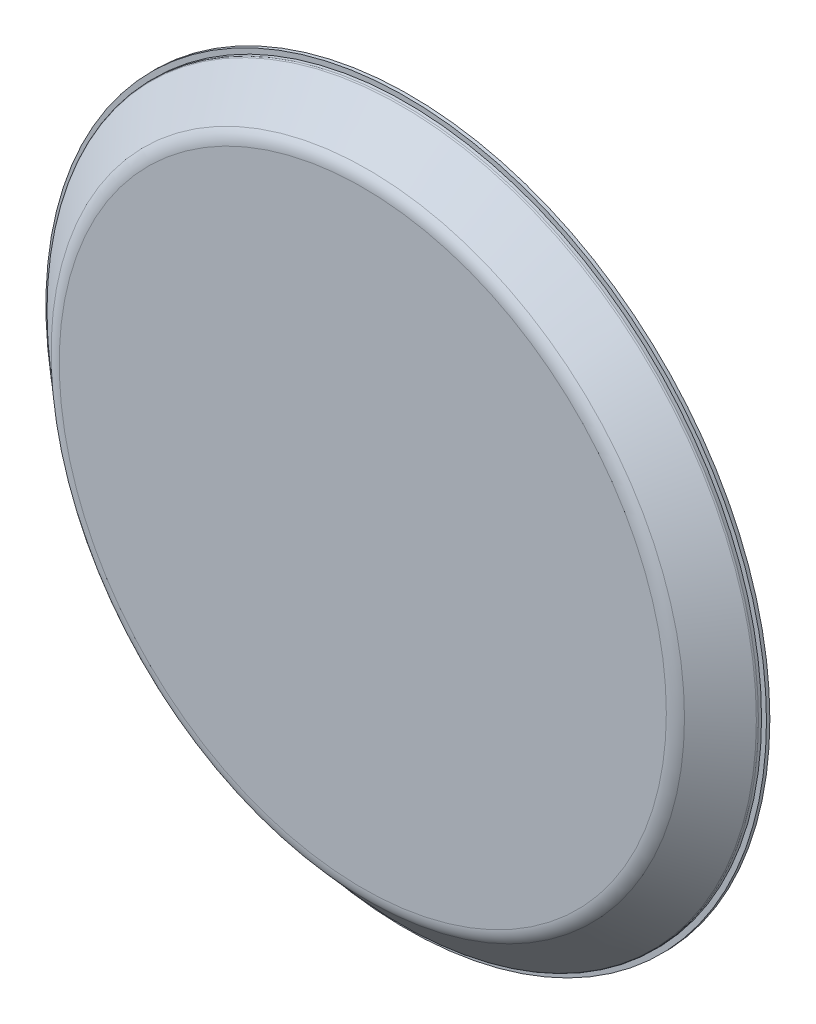
ISO-10303-21;
HEADER;
FILE_DESCRIPTION(('STEP AP214'),'2;1');
FILE_NAME('part.step','',(''),(''),'','','');
FILE_SCHEMA(('AUTOMOTIVE_DESIGN { 1 0 10303 214 1 1 1 1 }'));
ENDSEC;
DATA;
#1=APPLICATION_CONTEXT('core data for automotive mechanical design processes');
#2=APPLICATION_PROTOCOL_DEFINITION('international standard','automotive_design',2000,#1);
#3=PRODUCT_CONTEXT('',#1,'mechanical');
#4=PRODUCT('Part','Part','',(#3));
#5=PRODUCT_RELATED_PRODUCT_CATEGORY('part','',(#4));
#6=PRODUCT_DEFINITION_FORMATION('','',#4);
#7=PRODUCT_DEFINITION_CONTEXT('part definition',#1,'design');
#8=PRODUCT_DEFINITION('design','',#6,#7);
#9=PRODUCT_DEFINITION_SHAPE('','',#8);
#10=(LENGTH_UNIT() NAMED_UNIT(*) SI_UNIT(.MILLI.,.METRE.));
#11=(NAMED_UNIT(*) PLANE_ANGLE_UNIT() SI_UNIT($,.RADIAN.));
#12=(NAMED_UNIT(*) SI_UNIT($,.STERADIAN.) SOLID_ANGLE_UNIT());
#13=UNCERTAINTY_MEASURE_WITH_UNIT(LENGTH_MEASURE(1.E-05),#10,'distance_accuracy_value','');
#14=(GEOMETRIC_REPRESENTATION_CONTEXT(3) GLOBAL_UNCERTAINTY_ASSIGNED_CONTEXT((#13)) GLOBAL_UNIT_ASSIGNED_CONTEXT((#10,
#11,#12)) REPRESENTATION_CONTEXT('',''));
#15=CARTESIAN_POINT('',(0.,0.,0.));
#16=DIRECTION('',(0.,0.,1.));
#17=DIRECTION('',(1.,0.,0.));
#18=AXIS2_PLACEMENT_3D('',#15,#16,#17);
#19=CARTESIAN_POINT('',(0.,18.2536498750077,-0.368480901052237));
#20=DIRECTION('',(0.,0.,1.));
#21=DIRECTION('',(1.,0.,0.));
#22=AXIS2_PLACEMENT_3D('',#19,#20,#21);
#23=PLANE('',#22);
#24=CARTESIAN_POINT('',(0.,0.,-0.368480901052237));
#25=DIRECTION('',(0.,0.,1.));
#26=DIRECTION('',(1.,0.,0.));
#27=AXIS2_PLACEMENT_3D('',#24,#25,#26);
#28=CIRCLE('',#27,18.2536498750077);
#29=CARTESIAN_POINT('',(18.2536498750077,0.,-0.368480901052237));
#30=VERTEX_POINT('',#29);
#31=EDGE_CURVE('E83',#30,#30,#28,.T.);
#32=ORIENTED_EDGE('',*,*,#31,.F.);
#33=EDGE_LOOP('',(#32));
#34=FACE_BOUND('',#33,.T.);
#35=CARTESIAN_POINT('',(0.,0.,-0.368480901052237));
#36=DIRECTION('',(0.,0.,1.));
#37=DIRECTION('',(1.,0.,0.));
#38=AXIS2_PLACEMENT_3D('',#35,#36,#37);
#39=CIRCLE('',#38,17.5641984715067);
#40=CARTESIAN_POINT('',(17.5641984715067,0.,-0.368480901052237));
#41=VERTEX_POINT('',#40);
#42=EDGE_CURVE('E10',#41,#41,#39,.T.);
#43=ORIENTED_EDGE('',*,*,#42,.T.);
#44=EDGE_LOOP('',(#43));
#45=FACE_BOUND('',#44,.T.);
#46=ADVANCED_FACE('F36',(#34,#45),#23,.F.);
#47=CARTESIAN_POINT('',(0.,0.,-0.268480901052237));
#48=DIRECTION('',(0.,0.,1.));
#49=DIRECTION('',(1.,0.,0.));
#50=AXIS2_PLACEMENT_3D('',#47,#48,#49);
#51=TOROIDAL_SURFACE('',#50,17.5641984715067,0.0999999999999997);
#52=ORIENTED_EDGE('',*,*,#42,.F.);
#53=EDGE_LOOP('',(#52));
#54=FACE_BOUND('',#53,.T.);
#55=CARTESIAN_POINT('',(0.,0.,-0.343090579567605));
#56=DIRECTION('',(0.,0.,1.));
#57=DIRECTION('',(1.,0.,0.));
#58=AXIS2_PLACEMENT_3D('',#55,#56,#57);
#59=CIRCLE('',#58,17.4976147206974);
#60=CARTESIAN_POINT('',(17.4976147206974,0.,-0.343090579567605));
#61=VERTEX_POINT('',#60);
#62=EDGE_CURVE('E43',#61,#61,#59,.T.);
#63=ORIENTED_EDGE('',*,*,#62,.T.);
#64=EDGE_LOOP('',(#63));
#65=FACE_BOUND('',#64,.T.);
#66=ADVANCED_FACE('F91',(#54,#65),#51,.T.);
#67=CARTESIAN_POINT('',(0.,0.,1.29843871406147));
#68=DIRECTION('',(0.,0.,-1.));
#69=DIRECTION('',(-1.,0.,0.));
#70=AXIS2_PLACEMENT_3D('',#67,#68,#69);
#71=CONICAL_SURFACE('',#70,15.6582173995399,0.842180550877895);
#72=ORIENTED_EDGE('',*,*,#62,.F.);
#73=EDGE_LOOP('',(#72));
#74=FACE_BOUND('',#73,.T.);
#75=CARTESIAN_POINT('',(0.,0.,1.29843871406147));
#76=DIRECTION('',(0.,0.,1.));
#77=DIRECTION('',(1.,0.,0.));
#78=AXIS2_PLACEMENT_3D('',#75,#76,#77);
#79=CIRCLE('',#78,15.6582173995399);
#80=CARTESIAN_POINT('',(15.6582173995399,0.,1.29843871406147));
#81=VERTEX_POINT('',#80);
#82=EDGE_CURVE('E49',#81,#81,#79,.T.);
#83=ORIENTED_EDGE('',*,*,#82,.T.);
#84=EDGE_LOOP('',(#83));
#85=FACE_BOUND('',#84,.T.);
#86=ADVANCED_FACE('F95',(#74,#85),#71,.F.);
#87=CARTESIAN_POINT('',(0.,0.,1.));
#88=DIRECTION('',(0.,0.,1.));
#89=DIRECTION('',(1.,0.,0.));
#90=AXIS2_PLACEMENT_3D('',#87,#88,#89);
#91=TOROIDAL_SURFACE('',#90,15.3918823963027,0.4);
#92=ORIENTED_EDGE('',*,*,#82,.F.);
#93=EDGE_LOOP('',(#92));
#94=FACE_BOUND('',#93,.T.);
#95=CARTESIAN_POINT('',(0.,0.,1.4));
#96=DIRECTION('',(0.,0.,1.));
#97=DIRECTION('',(1.,0.,0.));
#98=AXIS2_PLACEMENT_3D('',#95,#96,#97);
#99=CIRCLE('',#98,15.3918823963027);
#100=CARTESIAN_POINT('',(15.3918823963027,0.,1.4));
#101=VERTEX_POINT('',#100);
#102=EDGE_CURVE('E55',#101,#101,#99,.T.);
#103=ORIENTED_EDGE('',*,*,#102,.T.);
#104=EDGE_LOOP('',(#103));
#105=FACE_BOUND('',#104,.T.);
#106=ADVANCED_FACE('F100',(#94,#105),#91,.F.);
#107=CARTESIAN_POINT('',(0.,15.3918823963027,1.4));
#108=DIRECTION('',(0.,0.,1.));
#109=DIRECTION('',(1.,0.,0.));
#110=AXIS2_PLACEMENT_3D('',#107,#108,#109);
#111=PLANE('',#110);
#112=ORIENTED_EDGE('',*,*,#102,.F.);
#113=EDGE_LOOP('',(#112));
#114=FACE_BOUND('',#113,.T.);
#115=ADVANCED_FACE('F106',(#114),#111,.F.);
#116=CARTESIAN_POINT('',(0.,0.,2.));
#117=DIRECTION('',(0.,0.,-1.));
#118=DIRECTION('',(-1.,0.,0.));
#119=AXIS2_PLACEMENT_3D('',#116,#117,#118);
#120=PLANE('',#119);
#121=CARTESIAN_POINT('',(0.,0.,2.));
#122=DIRECTION('',(0.,0.,1.));
#123=DIRECTION('',(1.,0.,0.));
#124=AXIS2_PLACEMENT_3D('',#121,#122,#123);
#125=CIRCLE('',#124,15.37759323569);
#126=CARTESIAN_POINT('',(15.37759323569,0.,2.));
#127=VERTEX_POINT('',#126);
#128=EDGE_CURVE('E61',#127,#127,#125,.T.);
#129=ORIENTED_EDGE('',*,*,#128,.T.);
#130=EDGE_LOOP('',(#129));
#131=FACE_BOUND('',#130,.T.);
#132=ADVANCED_FACE('F110',(#131),#120,.F.);
#133=CARTESIAN_POINT('',(0.,0.,1.));
#134=DIRECTION('',(0.,0.,1.));
#135=DIRECTION('',(1.,0.,0.));
#136=AXIS2_PLACEMENT_3D('',#133,#134,#135);
#137=TOROIDAL_SURFACE('',#136,15.37759323569,1.);
#138=ORIENTED_EDGE('',*,*,#128,.F.);
#139=EDGE_LOOP('',(#138));
#140=FACE_BOUND('',#139,.T.);
#141=CARTESIAN_POINT('',(0.,0.,1.74609678515368));
#142=DIRECTION('',(0.,0.,1.));
#143=DIRECTION('',(1.,0.,0.));
#144=AXIS2_PLACEMENT_3D('',#141,#142,#143);
#145=CIRCLE('',#144,16.0434307437829);
#146=CARTESIAN_POINT('',(16.0434307437829,0.,1.74609678515368));
#147=VERTEX_POINT('',#146);
#148=EDGE_CURVE('E65',#147,#147,#145,.T.);
#149=ORIENTED_EDGE('',*,*,#148,.T.);
#150=EDGE_LOOP('',(#149));
#151=FACE_BOUND('',#150,.T.);
#152=ADVANCED_FACE('F114',(#140,#151),#137,.T.);
#153=CARTESIAN_POINT('',(0.,0.,0.0296501132316662));
#154=DIRECTION('',(0.,0.,-1.));
#155=DIRECTION('',(-1.,0.,0.));
#156=AXIS2_PLACEMENT_3D('',#153,#154,#155);
#157=CONICAL_SURFACE('',#156,17.9667758966818,0.842180550877895);
#158=ORIENTED_EDGE('',*,*,#148,.F.);
#159=EDGE_LOOP('',(#158));
#160=FACE_BOUND('',#159,.T.);
#161=CARTESIAN_POINT('',(0.,0.,0.0296501132316662));
#162=DIRECTION('',(0.,0.,1.));
#163=DIRECTION('',(1.,0.,0.));
#164=AXIS2_PLACEMENT_3D('',#161,#162,#163);
#165=CIRCLE('',#164,17.9667758966818);
#166=CARTESIAN_POINT('',(17.9667758966818,0.,0.0296501132316662));
#167=VERTEX_POINT('',#166);
#168=EDGE_CURVE('E69',#167,#167,#165,.T.);
#169=ORIENTED_EDGE('',*,*,#168,.T.);
#170=EDGE_LOOP('',(#169));
#171=FACE_BOUND('',#170,.T.);
#172=ADVANCED_FACE('F118',(#160,#171),#157,.T.);
#173=CARTESIAN_POINT('',(0.,0.,-0.0449595652837015));
#174=DIRECTION('',(0.,0.,1.));
#175=DIRECTION('',(1.,0.,0.));
#176=AXIS2_PLACEMENT_3D('',#173,#174,#175);
#177=TOROIDAL_SURFACE('',#176,17.9001921458725,0.0999999999999998);
#178=ORIENTED_EDGE('',*,*,#168,.F.);
#179=EDGE_LOOP('',(#178));
#180=FACE_BOUND('',#179,.T.);
#181=CARTESIAN_POINT('',(0.,0.,-0.0445301436048477));
#182=DIRECTION('',(0.,0.,1.));
#183=DIRECTION('',(1.,0.,0.));
#184=AXIS2_PLACEMENT_3D('',#181,#182,#183);
#185=CIRCLE('',#184,18.0001912238534);
#186=CARTESIAN_POINT('',(18.0001912238534,0.,-0.0445301436048477));
#187=VERTEX_POINT('',#186);
#188=EDGE_CURVE('E73',#187,#187,#185,.T.);
#189=ORIENTED_EDGE('',*,*,#188,.T.);
#190=EDGE_LOOP('',(#189));
#191=FACE_BOUND('',#190,.T.);
#192=ADVANCED_FACE('F122',(#180,#191),#177,.T.);
#193=CARTESIAN_POINT('',(0.,0.,-0.199998155962271));
#194=DIRECTION('',(0.,0.,-1.));
#195=DIRECTION('',(-1.,0.,0.));
#196=AXIS2_PLACEMENT_3D('',#193,#194,#195);
#197=CONICAL_SURFACE('',#196,18.0008588433577,0.00429422998642117);
#198=ORIENTED_EDGE('',*,*,#188,.F.);
#199=EDGE_LOOP('',(#198));
#200=FACE_BOUND('',#199,.T.);
#201=CARTESIAN_POINT('',(0.,0.,-0.199998155962271));
#202=DIRECTION('',(0.,0.,1.));
#203=DIRECTION('',(1.,0.,0.));
#204=AXIS2_PLACEMENT_3D('',#201,#202,#203);
#205=CIRCLE('',#204,18.0008588433577);
#206=CARTESIAN_POINT('',(18.0008588433577,0.,-0.199998155962271));
#207=VERTEX_POINT('',#206);
#208=EDGE_CURVE('E76',#207,#207,#205,.T.);
#209=ORIENTED_EDGE('',*,*,#208,.T.);
#210=EDGE_LOOP('',(#209));
#211=FACE_BOUND('',#210,.T.);
#212=ADVANCED_FACE('F126',(#200,#211),#197,.T.);
#213=CARTESIAN_POINT('',(0.,18.0008588433577,-0.19999815596227));
#214=DIRECTION('',(0.,0.,-1.));
#215=DIRECTION('',(-1.,0.,0.));
#216=AXIS2_PLACEMENT_3D('',#213,#214,#215);
#217=PLANE('',#216);
#218=ORIENTED_EDGE('',*,*,#208,.F.);
#219=EDGE_LOOP('',(#218));
#220=FACE_BOUND('',#219,.T.);
#221=CARTESIAN_POINT('',(0.,0.,-0.199998155962271));
#222=DIRECTION('',(0.,0.,1.));
#223=DIRECTION('',(1.,0.,0.));
#224=AXIS2_PLACEMENT_3D('',#221,#222,#223);
#225=CIRCLE('',#224,18.2508588433577);
#226=CARTESIAN_POINT('',(18.2508588433577,0.,-0.199998155962271));
#227=VERTEX_POINT('',#226);
#228=EDGE_CURVE('E79',#227,#227,#225,.T.);
#229=ORIENTED_EDGE('',*,*,#228,.T.);
#230=EDGE_LOOP('',(#229));
#231=FACE_BOUND('',#230,.T.);
#232=ADVANCED_FACE('F130',(#220,#231),#217,.F.);
#233=CARTESIAN_POINT('',(0.,0.,-0.368480901052237));
#234=DIRECTION('',(0.,0.,-1.));
#235=DIRECTION('',(-1.,0.,0.));
#236=AXIS2_PLACEMENT_3D('',#233,#234,#235);
#237=CONICAL_SURFACE('',#236,18.2536498750077,0.016564167350286);
#238=ORIENTED_EDGE('',*,*,#228,.F.);
#239=EDGE_LOOP('',(#238));
#240=FACE_BOUND('',#239,.T.);
#241=ORIENTED_EDGE('',*,*,#31,.T.);
#242=EDGE_LOOP('',(#241));
#243=FACE_BOUND('',#242,.T.);
#244=ADVANCED_FACE('F88',(#240,#243),#237,.T.);
#245=CLOSED_SHELL('',(#46,#66,#86,#106,#115,#132,#152,#172,#192,#212,#232,#244));
#246=MANIFOLD_SOLID_BREP('B2',#245);
#247=ADVANCED_BREP_SHAPE_REPRESENTATION('',(#18,#246),#14);
#248=SHAPE_DEFINITION_REPRESENTATION(#9,#247);
ENDSEC;
END-ISO-10303-21;
